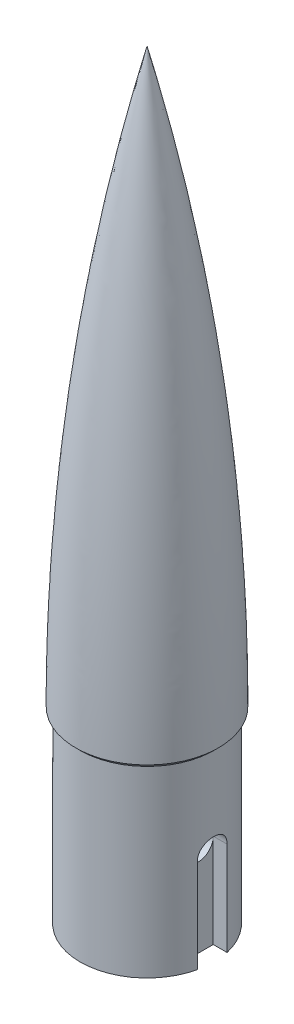
ISO-10303-21;
HEADER;
FILE_DESCRIPTION(('STEP AP214'),'2;1');
FILE_NAME('part.step','',(''),(''),'','','');
FILE_SCHEMA(('AUTOMOTIVE_DESIGN { 1 0 10303 214 1 1 1 1 }'));
ENDSEC;
DATA;
#1=APPLICATION_CONTEXT('core data for automotive mechanical design processes');
#2=APPLICATION_PROTOCOL_DEFINITION('international standard','automotive_design',2000,#1);
#3=PRODUCT_CONTEXT('',#1,'mechanical');
#4=PRODUCT('Part','Part','',(#3));
#5=PRODUCT_RELATED_PRODUCT_CATEGORY('part','',(#4));
#6=PRODUCT_DEFINITION_FORMATION('','',#4);
#7=PRODUCT_DEFINITION_CONTEXT('part definition',#1,'design');
#8=PRODUCT_DEFINITION('design','',#6,#7);
#9=PRODUCT_DEFINITION_SHAPE('','',#8);
#10=(LENGTH_UNIT() NAMED_UNIT(*) SI_UNIT(.MILLI.,.METRE.));
#11=(NAMED_UNIT(*) PLANE_ANGLE_UNIT() SI_UNIT($,.RADIAN.));
#12=(NAMED_UNIT(*) SI_UNIT($,.STERADIAN.) SOLID_ANGLE_UNIT());
#13=UNCERTAINTY_MEASURE_WITH_UNIT(LENGTH_MEASURE(1.E-05),#10,'distance_accuracy_value','');
#14=(GEOMETRIC_REPRESENTATION_CONTEXT(3) GLOBAL_UNCERTAINTY_ASSIGNED_CONTEXT((#13)) GLOBAL_UNIT_ASSIGNED_CONTEXT((#10,
#11,#12)) REPRESENTATION_CONTEXT('',''));
#15=CARTESIAN_POINT('',(0.,0.,0.));
#16=DIRECTION('',(0.,0.,1.));
#17=DIRECTION('',(1.,0.,0.));
#18=AXIS2_PLACEMENT_3D('',#15,#16,#17);
#19=CARTESIAN_POINT('',(0.,-25.,0.));
#20=DIRECTION('',(0.,1.,0.));
#21=DIRECTION('',(0.,0.,1.));
#22=AXIS2_PLACEMENT_3D('',#19,#20,#21);
#23=CYLINDRICAL_SURFACE('',#22,8.895);
#24=CARTESIAN_POINT('',(0.,-0.600000000000003,0.));
#25=DIRECTION('',(0.,-1.,0.));
#26=DIRECTION('',(0.,0.,-1.));
#27=AXIS2_PLACEMENT_3D('',#24,#25,#26);
#28=CIRCLE('',#27,8.895);
#29=CARTESIAN_POINT('',(0.,-0.600000000000003,-8.895));
#30=VERTEX_POINT('',#29);
#31=EDGE_CURVE('E11',#30,#30,#28,.T.);
#32=ORIENTED_EDGE('',*,*,#31,.T.);
#33=EDGE_LOOP('',(#32));
#34=FACE_BOUND('',#33,.T.);
#35=DIRECTION('',(0.,-1.,0.));
#36=VECTOR('',#35,1.);
#37=CARTESIAN_POINT('',(-8.67082930632215,-12.5,-1.98437499999999));
#38=LINE('',#37,#36);
#39=CARTESIAN_POINT('',(-8.67082930632215,-12.5,-1.984375));
#40=VERTEX_POINT('',#39);
#41=CARTESIAN_POINT('',(-8.67082930632215,-25.,-1.98437499999999));
#42=VERTEX_POINT('',#41);
#43=EDGE_CURVE('E183',#40,#42,#38,.T.);
#44=ORIENTED_EDGE('',*,*,#43,.F.);
#45=CARTESIAN_POINT('',(-8.895,-10.515625,0.));
#46=CARTESIAN_POINT('',(-8.89499798053136,-10.5156286782961,-0.110003108531044));
#47=CARTESIAN_POINT('',(-8.89293872905295,-10.5248028437771,-0.220050190385659));
#48=CARTESIAN_POINT('',(-8.88492294410009,-10.5612168017032,-0.437014773196951));
#49=CARTESIAN_POINT('',(-8.87896370197709,-10.5884691501126,-0.543930045069365));
#50=CARTESIAN_POINT('',(-8.86381097564101,-10.66014046251,-0.751464389222808));
#51=CARTESIAN_POINT('',(-8.85462093856362,-10.7045411348459,-0.852090038043748));
#52=CARTESIAN_POINT('',(-8.83399673910637,-10.809189812261,-1.04446068714721));
#53=CARTESIAN_POINT('',(-8.82256261666939,-10.8694375352822,-1.13620584545178));
#54=CARTESIAN_POINT('',(-8.79848845487047,-11.0051316026497,-1.30974205494041));
#55=CARTESIAN_POINT('',(-8.78583296110134,-11.0807914141361,-1.39136405863448));
#56=CARTESIAN_POINT('',(-8.76085045969245,-11.2447038420026,-1.54087074401027));
#57=CARTESIAN_POINT('',(-8.74852348238285,-11.332957616368,-1.60875416107165));
#58=CARTESIAN_POINT('',(-8.72544092397066,-11.520810939859,-1.72960902031442));
#59=CARTESIAN_POINT('',(-8.71470512331446,-11.6205296910602,-1.78239929438126));
#60=CARTESIAN_POINT('',(-8.69624278881732,-11.8277023668504,-1.87040686218199));
#61=CARTESIAN_POINT('',(-8.68851587956583,-11.9351553244818,-1.90562634832583));
#62=CARTESIAN_POINT('',(-8.67710379688232,-12.1529089981679,-1.95693151039241));
#63=CARTESIAN_POINT('',(-8.67335534128796,-12.2631356576469,-1.9733171227466));
#64=CARTESIAN_POINT('',(-8.67013460913494,-12.4848322544565,-1.98742225140913));
#65=CARTESIAN_POINT('',(-8.67066178498573,-12.5963020307519,-1.98514415802333));
#66=CARTESIAN_POINT('',(-8.6758755128654,-12.8150819521088,-1.96222763913715));
#67=CARTESIAN_POINT('',(-8.68048286491296,-12.9224308899092,-1.94193880078754));
#68=CARTESIAN_POINT('',(-8.69321246305035,-13.1321618701326,-1.88413107223078));
#69=CARTESIAN_POINT('',(-8.70133491344556,-13.2345436234669,-1.84661118050843));
#70=CARTESIAN_POINT('',(-8.72025684575896,-13.4324107413625,-1.75508849250558));
#71=CARTESIAN_POINT('',(-8.73107785800529,-13.5278322502844,-1.70095228060515));
#72=CARTESIAN_POINT('',(-8.75416459631689,-13.7083654708171,-1.57782741855743));
#73=CARTESIAN_POINT('',(-8.76643052669428,-13.7934757209513,-1.50883666682662));
#74=CARTESIAN_POINT('',(-8.79136402902234,-13.9529819654673,-1.35611581093398));
#75=CARTESIAN_POINT('',(-8.8040344247618,-14.0270934621295,-1.27208872607875));
#76=CARTESIAN_POINT('',(-8.82809796612522,-14.1602203300518,-1.09265382918496));
#77=CARTESIAN_POINT('',(-8.83949108676558,-14.2192354060537,-0.99724579460952));
#78=CARTESIAN_POINT('',(-8.85975573704167,-14.3205689320845,-0.797402322384055));
#79=CARTESIAN_POINT('',(-8.86862144653922,-14.3628489299928,-0.692946759215006));
#80=CARTESIAN_POINT('',(-8.88278925247284,-14.4291766978656,-0.478171595830713));
#81=CARTESIAN_POINT('',(-8.88809188846723,-14.4532272283998,-0.367852886206666));
#82=CARTESIAN_POINT('',(-8.89445888054048,-14.4819968395156,-0.146922244637292));
#83=CARTESIAN_POINT('',(-8.89560839126927,-14.487104381303,-0.0363632839080309));
#84=CARTESIAN_POINT('',(-8.89377875578923,-14.4788975892449,0.184028216567811));
#85=CARTESIAN_POINT('',(-8.8907999015053,-14.4655845579548,0.293860807125686));
#86=CARTESIAN_POINT('',(-8.88110209755264,-14.4212364374193,0.508386435136476));
#87=CARTESIAN_POINT('',(-8.87442639805636,-14.3904061793644,0.613123945630332));
#88=CARTESIAN_POINT('',(-8.85808259752387,-14.3121269856043,0.815940337496674));
#89=CARTESIAN_POINT('',(-8.84841423460527,-14.2646765954544,0.914018635217614));
#90=CARTESIAN_POINT('',(-8.82694819211914,-14.1537022358176,1.10233086452755));
#91=CARTESIAN_POINT('',(-8.81512120261388,-14.0899514567944,1.1924277186746));
#92=CARTESIAN_POINT('',(-8.79070766484064,-13.9484834474263,1.36078396392382));
#93=CARTESIAN_POINT('',(-8.77812101382286,-13.8707643249358,1.43904174866253));
#94=CARTESIAN_POINT('',(-8.75331093693519,-13.7017800928848,1.58304298834678));
#95=CARTESIAN_POINT('',(-8.74109914583823,-13.6102832900571,1.64851693602485));
#96=CARTESIAN_POINT('',(-8.71869698047453,-13.4173649355546,1.76317168339184));
#97=CARTESIAN_POINT('',(-8.70850651768816,-13.315943818784,1.81235319663538));
#98=CARTESIAN_POINT('',(-8.69140054463049,-13.1066041991113,1.89268852324433));
#99=CARTESIAN_POINT('',(-8.68446640876592,-12.9987267288714,1.92394509722755));
#100=CARTESIAN_POINT('',(-8.67462629679212,-12.7790753551192,1.96784118701104));
#101=CARTESIAN_POINT('',(-8.67171964652347,-12.6673021069317,1.98048381861487));
#102=CARTESIAN_POINT('',(-8.67030729710035,-12.4457524437848,1.9866564116767));
#103=CARTESIAN_POINT('',(-8.67170310734381,-12.3359883589578,1.98061409297813));
#104=CARTESIAN_POINT('',(-8.67851500496339,-12.1190849742809,1.95054750257742));
#105=CARTESIAN_POINT('',(-8.68393104095299,-12.0119456408994,1.92652346071756));
#106=CARTESIAN_POINT('',(-8.6981241844418,-11.8036893505729,1.86138575645093));
#107=CARTESIAN_POINT('',(-8.70688857054173,-11.7025512531436,1.82033672721598));
#108=CARTESIAN_POINT('',(-8.72679539432478,-11.5085347915276,1.72236893705458));
#109=CARTESIAN_POINT('',(-8.73793809113817,-11.4156573289467,1.66544844663638));
#110=CARTESIAN_POINT('',(-8.76163848646004,-11.238695474782,1.53594515186167));
#111=CARTESIAN_POINT('',(-8.77422098481682,-11.154836679788,1.46305855847869));
#112=CARTESIAN_POINT('',(-8.79921922589108,-11.0004001651611,1.30430465490752));
#113=CARTESIAN_POINT('',(-8.81163492929224,-10.9298255275292,1.21843434073407));
#114=CARTESIAN_POINT('',(-8.83510136371243,-10.8030382120514,1.03474108869537));
#115=CARTESIAN_POINT('',(-8.84613120897754,-10.7470341562857,0.936771332481138));
#116=CARTESIAN_POINT('',(-8.86537241774909,-10.6523773860926,0.732581640881906));
#117=CARTESIAN_POINT('',(-8.87358609932992,-10.6137103928671,0.626368579579056));
#118=CARTESIAN_POINT('',(-8.88483654653533,-10.5615673365609,0.43340420838887));
#119=CARTESIAN_POINT('',(-8.88862390497389,-10.5443723842688,0.347682052709739));
#120=CARTESIAN_POINT('',(-8.8937063738634,-10.5214000285145,0.174649120553264));
#121=CARTESIAN_POINT('',(-8.89500160338379,-10.5156220795683,0.0873384201749424));
#122=CARTESIAN_POINT('',(-8.895,-10.515625,0.));
#123=B_SPLINE_CURVE_WITH_KNOTS('',3,(#45,#46,#47,#48,#49,#50,#51,#52,#53,#54,#55,#56,#57,#58,
#59,#60,#61,#62,#63,#64,#65,#66,#67,#68,#69,#70,#71,#72,#73,#74,#75,#76,#77,#78,#79,#80,#81,#82,
#83,#84,#85,#86,#87,#88,#89,#90,#91,#92,#93,#94,#95,#96,#97,#98,#99,#100,#101,#102,#103,#104,
#105,#106,#107,#108,#109,#110,#111,#112,#113,#114,#115,#116,#117,#118,#119,#120,#121,#122),
.UNSPECIFIED.,.T.,.F.,(4,2,2,2,2,2,2,2,2,2,2,2,2,2,2,2,2,2,2,2,2,2,2,2,2,2,2,2,2,2,2,2,2,2,2,2,
2,2,4),(0.,0.32968958471569,0.659608391077071,0.989176249620352,1.31873824265806,
1.65322013476703,1.98773280154188,2.32610663322488,2.6644382334597,2.99730368340978,
3.33012650314447,3.65662716066737,3.98314679768962,4.31235992028412,4.64161964977686,
4.97829541698964,5.31497776845579,5.65242928429447,5.98982968812842,6.32027155964406,
6.65069006614927,6.9773221968005,7.30398291850589,7.63546294699817,7.96698791151875,
8.30488633992517,8.64276996754305,8.97869668766252,9.31456717032856,9.64280656540119,
9.97104176499135,10.2980421054524,10.6250780926347,10.9589814011184,11.2929620818613,
11.631489944489,11.9697384812382,12.2315123866697,12.493273784704),.UNSPECIFIED.);
#124=CARTESIAN_POINT('',(-8.67082930632215,-12.5,1.984375));
#125=VERTEX_POINT('',#124);
#126=EDGE_CURVE('E145',#125,#40,#123,.T.);
#127=ORIENTED_EDGE('',*,*,#126,.F.);
#128=DIRECTION('',(0.,-1.,0.));
#129=VECTOR('',#128,1.);
#130=CARTESIAN_POINT('',(-8.67082930632215,-12.5,1.984375));
#131=LINE('',#130,#129);
#132=CARTESIAN_POINT('',(-8.67082930632215,-25.,1.984375));
#133=VERTEX_POINT('',#132);
#134=EDGE_CURVE('E186',#125,#133,#131,.T.);
#135=ORIENTED_EDGE('',*,*,#134,.T.);
#136=CARTESIAN_POINT('',(0.,-25.,0.));
#137=DIRECTION('',(0.,1.,0.));
#138=DIRECTION('',(0.,0.,1.));
#139=AXIS2_PLACEMENT_3D('',#136,#137,#138);
#140=CIRCLE('',#139,8.895);
#141=CARTESIAN_POINT('',(8.67082930632215,-25.,1.984375));
#142=VERTEX_POINT('',#141);
#143=EDGE_CURVE('E192',#133,#142,#140,.T.);
#144=ORIENTED_EDGE('',*,*,#143,.T.);
#145=DIRECTION('',(0.,-1.,0.));
#146=VECTOR('',#145,1.);
#147=CARTESIAN_POINT('',(8.67082930632215,-12.5,1.984375));
#148=LINE('',#147,#146);
#149=CARTESIAN_POINT('',(8.67082930632215,-12.5,1.984375));
#150=VERTEX_POINT('',#149);
#151=EDGE_CURVE('E57',#150,#142,#148,.T.);
#152=ORIENTED_EDGE('',*,*,#151,.F.);
#153=CARTESIAN_POINT('',(8.67082930632215,-12.5,-1.984375));
#154=CARTESIAN_POINT('',(8.67083152693427,-12.3900352924012,-1.98437129476868));
#155=CARTESIAN_POINT('',(8.67294398159313,-12.2800265459929,-1.97520331559507));
#156=CARTESIAN_POINT('',(8.68114924080244,-12.0631415333078,-1.9388161542682));
#157=CARTESIAN_POINT('',(8.687244848201,-11.956267528248,-1.91158426077147));
#158=CARTESIAN_POINT('',(8.70269247518692,-11.748820633369,-1.83997273746253));
#159=CARTESIAN_POINT('',(8.71204083806803,-11.6482408168817,-1.79561235715901));
#160=CARTESIAN_POINT('',(8.73293623267991,-11.4559475998378,-1.69105869172377));
#161=CARTESIAN_POINT('',(8.74448323779282,-11.3642340919615,-1.63086559826731));
#162=CARTESIAN_POINT('',(8.76870152698746,-11.190664815864,-1.49522783567887));
#163=CARTESIAN_POINT('',(8.78138768085908,-11.1089875068265,-1.41955741552215));
#164=CARTESIAN_POINT('',(8.80632483899608,-10.959373320034,-1.25560020996667));
#165=CARTESIAN_POINT('',(8.81857580851969,-10.8914375372732,-1.16731242010812));
#166=CARTESIAN_POINT('',(8.8414245341093,-10.7705257147047,-0.979426653986215));
#167=CARTESIAN_POINT('',(8.85200269761223,-10.7177218091067,-0.879715314874414));
#168=CARTESIAN_POINT('',(8.87014575131516,-10.6296870280497,-0.672558617309702));
#169=CARTESIAN_POINT('',(8.8777109934971,-10.5944540997552,-0.56511416400382));
#170=CARTESIAN_POINT('',(8.88887072235122,-10.5431240620808,-0.347397468059264));
#171=CARTESIAN_POINT('',(8.89252784470798,-10.5267247747917,-0.237199733411299));
#172=CARTESIAN_POINT('',(8.89567645545256,-10.5125822573189,-0.0155605825450066));
#173=CARTESIAN_POINT('',(8.89516843879117,-10.5148368104668,0.0958806843305372));
#174=CARTESIAN_POINT('',(8.89009171695082,-10.5377139363359,0.31475870560092));
#175=CARTESIAN_POINT('',(8.88559503342556,-10.5580107416537,0.422231426260748));
#176=CARTESIAN_POINT('',(8.8731285194068,-10.6158765069307,0.63220575827785));
#177=CARTESIAN_POINT('',(8.86515852778899,-10.6534462681744,0.734707138772998));
#178=CARTESIAN_POINT('',(8.84652583210922,-10.7450763392216,0.932727372605715));
#179=CARTESIAN_POINT('',(8.83584323372576,-10.7992591265551,1.02818760316908));
#180=CARTESIAN_POINT('',(8.81295504188348,-10.9224856773742,1.2087789663073));
#181=CARTESIAN_POINT('',(8.80074923327929,-10.9915315411911,1.29390863638836));
#182=CARTESIAN_POINT('',(8.77584357058241,-11.1442943709138,1.45336071135604));
#183=CARTESIAN_POINT('',(8.76313874101006,-11.2282964215203,1.5274094616731));
#184=CARTESIAN_POINT('',(8.73891357366072,-11.4076579397835,1.66042127107666));
#185=CARTESIAN_POINT('',(8.72739327066983,-11.5030177408069,1.71938388720298));
#186=CARTESIAN_POINT('',(8.70682769295961,-11.7028425850512,1.82067818880462));
#187=CARTESIAN_POINT('',(8.69779041740815,-11.8073356589106,1.86295631105176));
#188=CARTESIAN_POINT('',(8.68332365321309,-12.022193123648,1.92926911648296));
#189=CARTESIAN_POINT('',(8.67789356668125,-12.1325565382453,1.95330682309304));
#190=CARTESIAN_POINT('',(8.67137842965835,-12.3535164219845,1.98202813124953));
#191=CARTESIAN_POINT('',(8.6702037566994,-12.4640584104577,1.98711100551234));
#192=CARTESIAN_POINT('',(8.67209039478514,-12.6844102825169,1.97886095731595));
#193=CARTESIAN_POINT('',(8.67515140212929,-12.7942202180243,1.96552935518464));
#194=CARTESIAN_POINT('',(8.68507970183092,-13.008588609668,1.92117571919051));
#195=CARTESIAN_POINT('',(8.69189929584423,-13.1131953191398,1.8903752346446));
#196=CARTESIAN_POINT('',(8.70853304572482,-13.3157631209793,1.81219878075513));
#197=CARTESIAN_POINT('',(8.71834749764175,-13.4137235551742,1.76482117265091));
#198=CARTESIAN_POINT('',(8.74006093984554,-13.6019411777236,1.65396154223488));
#199=CARTESIAN_POINT('',(8.75199070504297,-13.6920504352035,1.59023451518154));
#200=CARTESIAN_POINT('',(8.7765101984565,-13.8604425592094,1.4488041612309));
#201=CARTESIAN_POINT('',(8.78910001194908,-13.9387238925018,1.37109902523044));
#202=CARTESIAN_POINT('',(8.81381758079177,-14.0827966953209,1.20210799703321));
#203=CARTESIAN_POINT('',(8.82593157346983,-14.14831541272,1.11058721230565));
#204=CARTESIAN_POINT('',(8.84807556919855,-14.2630486894093,0.91760694147292));
#205=CARTESIAN_POINT('',(8.85810567158719,-14.3122640259399,0.816147929457443));
#206=CARTESIAN_POINT('',(8.87489393112164,-14.3926180815481,0.606815775294063));
#207=CARTESIAN_POINT('',(8.88167322724541,-14.423873857297,0.498989339167028));
#208=CARTESIAN_POINT('',(8.89128759699143,-14.4677855598397,0.279447263775833));
#209=CARTESIAN_POINT('',(8.89412326837703,-14.4804443055345,0.167732216568148));
#210=CARTESIAN_POINT('',(8.89551225388667,-14.4866716096712,-0.0538303410463871));
#211=CARTESIAN_POINT('',(8.89415677257247,-14.4806467378316,-0.1636660480899));
#212=CARTESIAN_POINT('',(8.88751206547856,-14.4505901194767,-0.380717396055891));
#213=CARTESIAN_POINT('',(8.88222291602629,-14.4265587223531,-0.487933087774485));
#214=CARTESIAN_POINT('',(8.86831291596493,-14.3613693329617,-0.696371660604404));
#215=CARTESIAN_POINT('',(8.85970370424092,-14.3202711322204,-0.797614067913526));
#216=CARTESIAN_POINT('',(8.84007111469181,-14.2221722616271,-0.991819184416284));
#217=CARTESIAN_POINT('',(8.82904749249992,-14.1651699819348,-1.08478105418124));
#218=CARTESIAN_POINT('',(8.80551621508588,-14.0355666300762,-1.26176241652204));
#219=CARTESIAN_POINT('',(8.79298364506869,-13.9626809241806,-1.34557017665365));
#220=CARTESIAN_POINT('',(8.76797805507896,-13.8039510336438,-1.49990415519922));
#221=CARTESIAN_POINT('',(8.7555050502752,-13.7181037126502,-1.57042714975871));
#222=CARTESIAN_POINT('',(8.73183513193552,-13.5344380779377,-1.69714603015807));
#223=CARTESIAN_POINT('',(8.72065858524308,-13.4364686619124,-1.75312694377475));
#224=CARTESIAN_POINT('',(8.7011051990314,-13.2322823615859,-1.84774053682795));
#225=CARTESIAN_POINT('',(8.69272603418347,-13.126072418212,-1.88638763425605));
#226=CARTESIAN_POINT('',(8.68123438698859,-12.9331580464439,-1.93848519859973));
#227=CARTESIAN_POINT('',(8.67735881646133,-12.847485490319,-1.95566030472962));
#228=CARTESIAN_POINT('',(8.67215546197685,-12.6745511498479,-1.97860637521381));
#229=CARTESIAN_POINT('',(8.67082754361105,-12.5872894495867,-1.98437794119458));
#230=CARTESIAN_POINT('',(8.67082930632215,-12.5,-1.984375));
#231=B_SPLINE_CURVE_WITH_KNOTS('',3,(#153,#154,#155,#156,#157,#158,#159,#160,#161,#162,#163,
#164,#165,#166,#167,#168,#169,#170,#171,#172,#173,#174,#175,#176,#177,#178,#179,#180,#181,#182,
#183,#184,#185,#186,#187,#188,#189,#190,#191,#192,#193,#194,#195,#196,#197,#198,#199,#200,#201,
#202,#203,#204,#205,#206,#207,#208,#209,#210,#211,#212,#213,#214,#215,#216,#217,#218,#219,#220,
#221,#222,#223,#224,#225,#226,#227,#228,#229,#230),.UNSPECIFIED.,.T.,.F.,(4,2,2,2,2,2,2,2,2,2,2,
2,2,2,2,2,2,2,2,2,2,2,2,2,2,2,2,2,2,2,2,2,2,2,2,2,2,2,4),(0.,0.329574133527324,
0.659380430494616,0.988817154975628,1.31824989138673,1.6528827972829,1.98754235792109,
2.32587008991828,2.66415828546683,2.99693943397993,3.32968103809655,3.65653406946799,
3.98340226493483,4.31274068542326,4.6421256759768,4.97863673959058,5.31515768273329,
5.65275035769749,5.99028706301795,6.32067223910689,6.65103372763026,6.97729620213301,
7.30359093900236,7.63509437723089,7.96664075087856,8.30464018838773,8.64262350993627,
8.97837818149084,9.31408195476448,9.64253221398148,9.97097610023751,10.2982789020109,
10.6256148460068,10.9593860612475,11.2932381697132,11.6317758832356,11.9700314818907,
12.2316596280387,12.4932739708748),.UNSPECIFIED.);
#232=CARTESIAN_POINT('',(8.67082930632215,-12.5,-1.984375));
#233=VERTEX_POINT('',#232);
#234=EDGE_CURVE('E123',#233,#150,#231,.T.);
#235=ORIENTED_EDGE('',*,*,#234,.F.);
#236=DIRECTION('',(0.,-1.,0.));
#237=VECTOR('',#236,1.);
#238=CARTESIAN_POINT('',(8.67082930632215,-12.5,-1.98437499999999));
#239=LINE('',#238,#237);
#240=CARTESIAN_POINT('',(8.67082930632215,-25.,-1.98437499999999));
#241=VERTEX_POINT('',#240);
#242=EDGE_CURVE('E157',#233,#241,#239,.T.);
#243=ORIENTED_EDGE('',*,*,#242,.T.);
#244=EDGE_CURVE('E185',#241,#42,#140,.T.);
#245=ORIENTED_EDGE('',*,*,#244,.T.);
#246=EDGE_LOOP('',(#44,#127,#135,#144,#152,#235,#243,#245));
#247=FACE_BOUND('',#246,.T.);
#248=ADVANCED_FACE('F41',(#34,#247),#23,.T.);
#249=CARTESIAN_POINT('',(0.,-25.,0.));
#250=DIRECTION('',(0.,1.,0.));
#251=DIRECTION('',(0.,0.,1.));
#252=AXIS2_PLACEMENT_3D('',#249,#250,#251);
#253=PLANE('',#252);
#254=DIRECTION('',(-1.,0.,0.));
#255=VECTOR('',#254,1.);
#256=CARTESIAN_POINT('',(6.83125,-25.,-1.984375));
#257=LINE('',#256,#255);
#258=CARTESIAN_POINT('',(6.83125,-25.,-1.984375));
#259=VERTEX_POINT('',#258);
#260=EDGE_CURVE('E150',#241,#259,#257,.T.);
#261=ORIENTED_EDGE('',*,*,#260,.T.);
#262=DIRECTION('',(0.,0.,1.));
#263=VECTOR('',#262,1.);
#264=CARTESIAN_POINT('',(6.83125,-25.,1.984375));
#265=LINE('',#264,#263);
#266=CARTESIAN_POINT('',(6.83125,-25.,1.984375));
#267=VERTEX_POINT('',#266);
#268=EDGE_CURVE('E155',#259,#267,#265,.T.);
#269=ORIENTED_EDGE('',*,*,#268,.T.);
#270=DIRECTION('',(1.,0.,0.));
#271=VECTOR('',#270,1.);
#272=CARTESIAN_POINT('',(6.83125,-25.,1.984375));
#273=LINE('',#272,#271);
#274=EDGE_CURVE('E160',#267,#142,#273,.T.);
#275=ORIENTED_EDGE('',*,*,#274,.T.);
#276=ORIENTED_EDGE('',*,*,#143,.F.);
#277=DIRECTION('',(-1.,0.,0.));
#278=VECTOR('',#277,1.);
#279=CARTESIAN_POINT('',(-6.83125,-25.,1.984375));
#280=LINE('',#279,#278);
#281=CARTESIAN_POINT('',(-6.83125,-25.,1.984375));
#282=VERTEX_POINT('',#281);
#283=EDGE_CURVE('E175',#282,#133,#280,.T.);
#284=ORIENTED_EDGE('',*,*,#283,.F.);
#285=DIRECTION('',(0.,0.,1.));
#286=VECTOR('',#285,1.);
#287=CARTESIAN_POINT('',(-6.83125,-25.,1.984375));
#288=LINE('',#287,#286);
#289=CARTESIAN_POINT('',(-6.83125,-25.,-1.984375));
#290=VERTEX_POINT('',#289);
#291=EDGE_CURVE('E179',#290,#282,#288,.T.);
#292=ORIENTED_EDGE('',*,*,#291,.F.);
#293=DIRECTION('',(1.,0.,0.));
#294=VECTOR('',#293,1.);
#295=CARTESIAN_POINT('',(-6.83125,-25.,-1.984375));
#296=LINE('',#295,#294);
#297=EDGE_CURVE('E65',#42,#290,#296,.T.);
#298=ORIENTED_EDGE('',*,*,#297,.F.);
#299=ORIENTED_EDGE('',*,*,#244,.F.);
#300=EDGE_LOOP('',(#261,#269,#275,#276,#284,#292,#298,#299));
#301=FACE_BOUND('',#300,.T.);
#302=ADVANCED_FACE('F205',(#301),#253,.F.);
#303=CARTESIAN_POINT('',(-6.83125,-12.5,-1.984375));
#304=DIRECTION('',(0.,0.,-1.));
#305=DIRECTION('',(-1.,0.,0.));
#306=AXIS2_PLACEMENT_3D('',#303,#304,#305);
#307=PLANE('',#306);
#308=ORIENTED_EDGE('',*,*,#297,.T.);
#309=DIRECTION('',(0.,-1.,0.));
#310=VECTOR('',#309,1.);
#311=CARTESIAN_POINT('',(-6.83125,-12.5,-1.984375));
#312=LINE('',#311,#310);
#313=CARTESIAN_POINT('',(-6.83125,-12.5,-1.984375));
#314=VERTEX_POINT('',#313);
#315=EDGE_CURVE('E177',#314,#290,#312,.T.);
#316=ORIENTED_EDGE('',*,*,#315,.F.);
#317=DIRECTION('',(1.,0.,0.));
#318=VECTOR('',#317,1.);
#319=CARTESIAN_POINT('',(-6.83125,-12.5,-1.984375));
#320=LINE('',#319,#318);
#321=EDGE_CURVE('E172',#40,#314,#320,.T.);
#322=ORIENTED_EDGE('',*,*,#321,.F.);
#323=ORIENTED_EDGE('',*,*,#43,.T.);
#324=EDGE_LOOP('',(#308,#316,#322,#323));
#325=FACE_BOUND('',#324,.T.);
#326=ADVANCED_FACE('F210',(#325),#307,.F.);
#327=CARTESIAN_POINT('',(-6.83125,-12.5,1.984375));
#328=DIRECTION('',(0.,0.,1.));
#329=DIRECTION('',(1.,0.,0.));
#330=AXIS2_PLACEMENT_3D('',#327,#328,#329);
#331=PLANE('',#330);
#332=ORIENTED_EDGE('',*,*,#283,.T.);
#333=ORIENTED_EDGE('',*,*,#134,.F.);
#334=DIRECTION('',(-1.,0.,0.));
#335=VECTOR('',#334,1.);
#336=CARTESIAN_POINT('',(-6.83125,-12.5,1.984375));
#337=LINE('',#336,#335);
#338=CARTESIAN_POINT('',(-6.83125,-12.5,1.984375));
#339=VERTEX_POINT('',#338);
#340=EDGE_CURVE('E174',#339,#125,#337,.T.);
#341=ORIENTED_EDGE('',*,*,#340,.F.);
#342=DIRECTION('',(0.,-1.,0.));
#343=VECTOR('',#342,1.);
#344=CARTESIAN_POINT('',(-6.83125,-12.5,1.984375));
#345=LINE('',#344,#343);
#346=EDGE_CURVE('E189',#339,#282,#345,.T.);
#347=ORIENTED_EDGE('',*,*,#346,.T.);
#348=EDGE_LOOP('',(#332,#333,#341,#347));
#349=FACE_BOUND('',#348,.T.);
#350=ADVANCED_FACE('F228',(#349),#331,.F.);
#351=CARTESIAN_POINT('',(-6.83125,-12.5,1.984375));
#352=DIRECTION('',(1.,0.,0.));
#353=DIRECTION('',(0.,0.,-1.));
#354=AXIS2_PLACEMENT_3D('',#351,#352,#353);
#355=PLANE('',#354);
#356=ORIENTED_EDGE('',*,*,#346,.F.);
#357=CARTESIAN_POINT('',(-6.83125,-12.5,0.));
#358=DIRECTION('',(1.,0.,0.));
#359=DIRECTION('',(0.,0.,-1.));
#360=AXIS2_PLACEMENT_3D('',#357,#358,#359);
#361=CIRCLE('',#360,1.984375);
#362=EDGE_CURVE('E131',#339,#314,#361,.T.);
#363=ORIENTED_EDGE('',*,*,#362,.T.);
#364=ORIENTED_EDGE('',*,*,#315,.T.);
#365=ORIENTED_EDGE('',*,*,#291,.T.);
#366=EDGE_LOOP('',(#356,#363,#364,#365));
#367=FACE_BOUND('',#366,.T.);
#368=ADVANCED_FACE('F223',(#367),#355,.F.);
#369=CARTESIAN_POINT('',(6.83125,-12.5,-1.984375));
#370=DIRECTION('',(0.,0.,1.));
#371=DIRECTION('',(1.,0.,0.));
#372=AXIS2_PLACEMENT_3D('',#369,#370,#371);
#373=PLANE('',#372);
#374=ORIENTED_EDGE('',*,*,#260,.F.);
#375=ORIENTED_EDGE('',*,*,#242,.F.);
#376=DIRECTION('',(-1.,0.,0.));
#377=VECTOR('',#376,1.);
#378=CARTESIAN_POINT('',(6.83125,-12.5,-1.984375));
#379=LINE('',#378,#377);
#380=CARTESIAN_POINT('',(6.83125,-12.5,-1.984375));
#381=VERTEX_POINT('',#380);
#382=EDGE_CURVE('E151',#233,#381,#379,.T.);
#383=ORIENTED_EDGE('',*,*,#382,.T.);
#384=DIRECTION('',(0.,-1.,0.));
#385=VECTOR('',#384,1.);
#386=CARTESIAN_POINT('',(6.83125,-12.5,-1.984375));
#387=LINE('',#386,#385);
#388=EDGE_CURVE('E164',#381,#259,#387,.T.);
#389=ORIENTED_EDGE('',*,*,#388,.T.);
#390=EDGE_LOOP('',(#374,#375,#383,#389));
#391=FACE_BOUND('',#390,.T.);
#392=ADVANCED_FACE('F236',(#391),#373,.T.);
#393=CARTESIAN_POINT('',(6.83125,-12.5,1.984375));
#394=DIRECTION('',(1.,0.,0.));
#395=DIRECTION('',(0.,0.,-1.));
#396=AXIS2_PLACEMENT_3D('',#393,#394,#395);
#397=PLANE('',#396);
#398=CARTESIAN_POINT('',(6.83125,-12.5,0.));
#399=DIRECTION('',(1.,0.,0.));
#400=DIRECTION('',(0.,0.,-1.));
#401=AXIS2_PLACEMENT_3D('',#398,#399,#400);
#402=CIRCLE('',#401,1.984375);
#403=CARTESIAN_POINT('',(6.83125,-12.5,1.984375));
#404=VERTEX_POINT('',#403);
#405=EDGE_CURVE('E121',#404,#381,#402,.T.);
#406=ORIENTED_EDGE('',*,*,#405,.F.);
#407=DIRECTION('',(0.,-1.,0.));
#408=VECTOR('',#407,1.);
#409=CARTESIAN_POINT('',(6.83125,-12.5,1.984375));
#410=LINE('',#409,#408);
#411=EDGE_CURVE('E167',#404,#267,#410,.T.);
#412=ORIENTED_EDGE('',*,*,#411,.T.);
#413=ORIENTED_EDGE('',*,*,#268,.F.);
#414=ORIENTED_EDGE('',*,*,#388,.F.);
#415=EDGE_LOOP('',(#406,#412,#413,#414));
#416=FACE_BOUND('',#415,.T.);
#417=ADVANCED_FACE('F142',(#416),#397,.T.);
#418=CARTESIAN_POINT('',(6.83125,-12.5,1.984375));
#419=DIRECTION('',(0.,0.,-1.));
#420=DIRECTION('',(-1.,0.,0.));
#421=AXIS2_PLACEMENT_3D('',#418,#419,#420);
#422=PLANE('',#421);
#423=ORIENTED_EDGE('',*,*,#274,.F.);
#424=ORIENTED_EDGE('',*,*,#411,.F.);
#425=DIRECTION('',(1.,0.,0.));
#426=VECTOR('',#425,1.);
#427=CARTESIAN_POINT('',(6.83125,-12.5,1.984375));
#428=LINE('',#427,#426);
#429=EDGE_CURVE('E154',#404,#150,#428,.T.);
#430=ORIENTED_EDGE('',*,*,#429,.T.);
#431=ORIENTED_EDGE('',*,*,#151,.T.);
#432=EDGE_LOOP('',(#423,#424,#430,#431));
#433=FACE_BOUND('',#432,.T.);
#434=ADVANCED_FACE('F140',(#433),#422,.T.);
#435=CARTESIAN_POINT('',(-8.895,-12.5,0.));
#436=DIRECTION('',(1.,0.,0.));
#437=DIRECTION('',(0.,0.,-1.));
#438=AXIS2_PLACEMENT_3D('',#435,#436,#437);
#439=CYLINDRICAL_SURFACE('',#438,1.984375);
#440=ORIENTED_EDGE('',*,*,#126,.T.);
#441=ORIENTED_EDGE('',*,*,#321,.T.);
#442=ORIENTED_EDGE('',*,*,#362,.F.);
#443=ORIENTED_EDGE('',*,*,#340,.T.);
#444=EDGE_LOOP('',(#440,#441,#442,#443));
#445=FACE_BOUND('',#444,.T.);
#446=ORIENTED_EDGE('',*,*,#234,.T.);
#447=ORIENTED_EDGE('',*,*,#429,.F.);
#448=ORIENTED_EDGE('',*,*,#405,.T.);
#449=ORIENTED_EDGE('',*,*,#382,.F.);
#450=EDGE_LOOP('',(#446,#447,#448,#449));
#451=FACE_BOUND('',#450,.T.);
#452=ADVANCED_FACE('F135',(#445,#451),#439,.F.);
#453=CARTESIAN_POINT('',(0.,0.,0.));
#454=DIRECTION('',(0.,-1.,0.));
#455=DIRECTION('',(0.,0.,-1.));
#456=AXIS2_PLACEMENT_3D('',#453,#454,#455);
#457=PLANE('',#456);
#458=CARTESIAN_POINT('',(0.,0.,0.));
#459=DIRECTION('',(0.,-1.,0.));
#460=DIRECTION('',(0.,0.,-1.));
#461=AXIS2_PLACEMENT_3D('',#458,#459,#460);
#462=CIRCLE('',#461,9.49500000000002);
#463=CARTESIAN_POINT('',(0.,0.,-9.49500000000002));
#464=VERTEX_POINT('',#463);
#465=EDGE_CURVE('E50',#464,#464,#462,.F.);
#466=ORIENTED_EDGE('',*,*,#465,.T.);
#467=EDGE_LOOP('',(#466));
#468=FACE_BOUND('',#467,.T.);
#469=CARTESIAN_POINT('',(0.,0.,0.));
#470=DIRECTION('',(0.,-1.,0.));
#471=DIRECTION('',(0.,0.,-1.));
#472=AXIS2_PLACEMENT_3D('',#469,#470,#471);
#473=CIRCLE('',#472,9.50000000000001);
#474=CARTESIAN_POINT('',(0.,0.,-9.50000000000001));
#475=VERTEX_POINT('',#474);
#476=EDGE_CURVE('E119',#475,#475,#473,.T.);
#477=ORIENTED_EDGE('',*,*,#476,.T.);
#478=EDGE_LOOP('',(#477));
#479=FACE_BOUND('',#478,.T.);
#480=ADVANCED_FACE('F115',(#468,#479),#457,.T.);
#481=CARTESIAN_POINT('',(0.,0.,300.852105263158));
#482=DIRECTION('',(-1.,0.,0.));
#483=DIRECTION('',(0.,0.,-1.));
#484=AXIS2_PLACEMENT_3D('',#481,#482,#483);
#485=CIRCLE('',#484,310.352105263158);
#486=TRIMMED_CURVE('',#485,(PARAMETER_VALUE(-0.248063889939775)),
(PARAMETER_VALUE(0.248063889939775)),.T.,.PARAMETER.);
#487=CARTESIAN_POINT('',(0.,0.,0.));
#488=DIRECTION('',(0.,-1.,0.));
#489=AXIS1_PLACEMENT('',#487,#488);
#490=SURFACE_OF_REVOLUTION('',#486,#489);
#491=CARTESIAN_POINT('',(0.,76.2,0.));
#492=VERTEX_POINT('',#491);
#493=VERTEX_LOOP('',#492);
#494=FACE_BOUND('',#493,.T.);
#495=ORIENTED_EDGE('',*,*,#476,.F.);
#496=EDGE_LOOP('',(#495));
#497=FACE_BOUND('',#496,.T.);
#498=ADVANCED_FACE('F112',(#494,#497),#490,.T.);
#499=CARTESIAN_POINT('',(0.,0.,0.));
#500=DIRECTION('',(0.,1.,0.));
#501=DIRECTION('',(0.,0.,1.));
#502=AXIS2_PLACEMENT_3D('',#499,#500,#501);
#503=CONICAL_SURFACE('',#502,9.49500000000002,0.78539816339746);
#504=ORIENTED_EDGE('',*,*,#31,.F.);
#505=EDGE_LOOP('',(#504));
#506=FACE_BOUND('',#505,.T.);
#507=ORIENTED_EDGE('',*,*,#465,.F.);
#508=EDGE_LOOP('',(#507));
#509=FACE_BOUND('',#508,.T.);
#510=ADVANCED_FACE('F44',(#506,#509),#503,.T.);
#511=CLOSED_SHELL('',(#248,#302,#326,#350,#368,#392,#417,#434,#452,#480,#498,#510));
#512=MANIFOLD_SOLID_BREP('B2',#511);
#513=ADVANCED_BREP_SHAPE_REPRESENTATION('',(#18,#512),#14);
#514=SHAPE_DEFINITION_REPRESENTATION(#9,#513);
ENDSEC;
END-ISO-10303-21;
